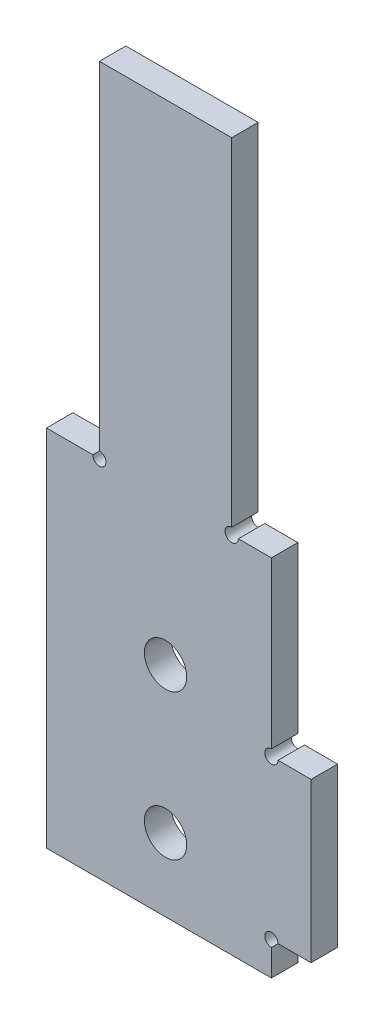
ISO-10303-21;
HEADER;
FILE_DESCRIPTION(('STEP AP214'),'2;1');
FILE_NAME('part.step','',(''),(''),'','','');
FILE_SCHEMA(('AUTOMOTIVE_DESIGN { 1 0 10303 214 1 1 1 1 }'));
ENDSEC;
DATA;
#1=APPLICATION_CONTEXT('core data for automotive mechanical design processes');
#2=APPLICATION_PROTOCOL_DEFINITION('international standard','automotive_design',2000,#1);
#3=PRODUCT_CONTEXT('',#1,'mechanical');
#4=PRODUCT('Part','Part','',(#3));
#5=PRODUCT_RELATED_PRODUCT_CATEGORY('part','',(#4));
#6=PRODUCT_DEFINITION_FORMATION('','',#4);
#7=PRODUCT_DEFINITION_CONTEXT('part definition',#1,'design');
#8=PRODUCT_DEFINITION('design','',#6,#7);
#9=PRODUCT_DEFINITION_SHAPE('','',#8);
#10=(LENGTH_UNIT() NAMED_UNIT(*) SI_UNIT(.MILLI.,.METRE.));
#11=(NAMED_UNIT(*) PLANE_ANGLE_UNIT() SI_UNIT($,.RADIAN.));
#12=(NAMED_UNIT(*) SI_UNIT($,.STERADIAN.) SOLID_ANGLE_UNIT());
#13=UNCERTAINTY_MEASURE_WITH_UNIT(LENGTH_MEASURE(1.E-05),#10,'distance_accuracy_value','');
#14=(GEOMETRIC_REPRESENTATION_CONTEXT(3) GLOBAL_UNCERTAINTY_ASSIGNED_CONTEXT((#13)) GLOBAL_UNIT_ASSIGNED_CONTEXT((#10,
#11,#12)) REPRESENTATION_CONTEXT('',''));
#15=CARTESIAN_POINT('',(0.,0.,0.));
#16=DIRECTION('',(0.,0.,1.));
#17=DIRECTION('',(1.,0.,0.));
#18=AXIS2_PLACEMENT_3D('',#15,#16,#17);
#19=CARTESIAN_POINT('',(0.,0.,2.));
#20=DIRECTION('',(1.,0.,0.));
#21=DIRECTION('',(0.,0.,-1.));
#22=AXIS2_PLACEMENT_3D('',#19,#20,#21);
#23=PLANE('',#22);
#24=DIRECTION('',(0.,-1.,0.));
#25=VECTOR('',#24,1.);
#26=CARTESIAN_POINT('',(0.,0.,2.));
#27=LINE('',#26,#25);
#28=CARTESIAN_POINT('',(0.,27.5,2.));
#29=VERTEX_POINT('',#28);
#30=CARTESIAN_POINT('',(0.,0.,2.));
#31=VERTEX_POINT('',#30);
#32=EDGE_CURVE('E194',#29,#31,#27,.T.);
#33=ORIENTED_EDGE('',*,*,#32,.F.);
#34=DIRECTION('',(0.,0.,1.));
#35=VECTOR('',#34,1.);
#36=CARTESIAN_POINT('',(0.,27.5,0.));
#37=LINE('',#36,#35);
#38=CARTESIAN_POINT('',(0.,27.5,0.));
#39=VERTEX_POINT('',#38);
#40=EDGE_CURVE('E230',#39,#29,#37,.T.);
#41=ORIENTED_EDGE('',*,*,#40,.F.);
#42=DIRECTION('',(0.,-1.,0.));
#43=VECTOR('',#42,1.);
#44=CARTESIAN_POINT('',(0.,0.,0.));
#45=LINE('',#44,#43);
#46=CARTESIAN_POINT('',(0.,0.,0.));
#47=VERTEX_POINT('',#46);
#48=EDGE_CURVE('E177',#39,#47,#45,.T.);
#49=ORIENTED_EDGE('',*,*,#48,.T.);
#50=DIRECTION('',(0.,0.,-1.));
#51=VECTOR('',#50,1.);
#52=CARTESIAN_POINT('',(0.,0.,2.));
#53=LINE('',#52,#51);
#54=EDGE_CURVE('E201',#31,#47,#53,.T.);
#55=ORIENTED_EDGE('',*,*,#54,.F.);
#56=EDGE_LOOP('',(#33,#41,#49,#55));
#57=FACE_BOUND('',#56,.T.);
#58=ADVANCED_FACE('F34',(#57),#23,.F.);
#59=CARTESIAN_POINT('',(0.,0.,2.));
#60=DIRECTION('',(0.,1.,0.));
#61=DIRECTION('',(-1.,0.,0.));
#62=AXIS2_PLACEMENT_3D('',#59,#60,#61);
#63=PLANE('',#62);
#64=DIRECTION('',(1.,0.,0.));
#65=VECTOR('',#64,1.);
#66=CARTESIAN_POINT('',(0.,0.,0.));
#67=LINE('',#66,#65);
#68=CARTESIAN_POINT('',(17.,0.,0.));
#69=VERTEX_POINT('',#68);
#70=EDGE_CURVE('E179',#47,#69,#67,.T.);
#71=ORIENTED_EDGE('',*,*,#70,.T.);
#72=DIRECTION('',(0.,0.,-1.));
#73=VECTOR('',#72,1.);
#74=CARTESIAN_POINT('',(17.,0.,2.));
#75=LINE('',#74,#73);
#76=CARTESIAN_POINT('',(17.,0.,2.));
#77=VERTEX_POINT('',#76);
#78=EDGE_CURVE('E198',#77,#69,#75,.T.);
#79=ORIENTED_EDGE('',*,*,#78,.F.);
#80=DIRECTION('',(1.,0.,0.));
#81=VECTOR('',#80,1.);
#82=CARTESIAN_POINT('',(0.,0.,2.));
#83=LINE('',#82,#81);
#84=EDGE_CURVE('E169',#31,#77,#83,.T.);
#85=ORIENTED_EDGE('',*,*,#84,.F.);
#86=ORIENTED_EDGE('',*,*,#54,.T.);
#87=EDGE_LOOP('',(#71,#79,#85,#86));
#88=FACE_BOUND('',#87,.T.);
#89=ADVANCED_FACE('F257',(#88),#63,.F.);
#90=CARTESIAN_POINT('',(17.,0.,2.));
#91=DIRECTION('',(-1.,0.,0.));
#92=DIRECTION('',(0.,0.,1.));
#93=AXIS2_PLACEMENT_3D('',#90,#91,#92);
#94=PLANE('',#93);
#95=DIRECTION('',(0.,1.,0.));
#96=VECTOR('',#95,1.);
#97=CARTESIAN_POINT('',(17.,0.,0.));
#98=LINE('',#97,#96);
#99=CARTESIAN_POINT('',(17.,2.,0.));
#100=VERTEX_POINT('',#99);
#101=EDGE_CURVE('E182',#69,#100,#98,.T.);
#102=ORIENTED_EDGE('',*,*,#101,.T.);
#103=DIRECTION('',(0.,0.,-1.));
#104=VECTOR('',#103,1.);
#105=CARTESIAN_POINT('',(17.,2.,2.));
#106=LINE('',#105,#104);
#107=CARTESIAN_POINT('',(17.,2.,2.));
#108=VERTEX_POINT('',#107);
#109=EDGE_CURVE('E48',#100,#108,#106,.F.);
#110=ORIENTED_EDGE('',*,*,#109,.T.);
#111=DIRECTION('',(0.,1.,0.));
#112=VECTOR('',#111,1.);
#113=CARTESIAN_POINT('',(17.,0.,2.));
#114=LINE('',#113,#112);
#115=EDGE_CURVE('E159',#77,#108,#114,.T.);
#116=ORIENTED_EDGE('',*,*,#115,.F.);
#117=ORIENTED_EDGE('',*,*,#78,.T.);
#118=EDGE_LOOP('',(#102,#110,#116,#117));
#119=FACE_BOUND('',#118,.T.);
#120=ADVANCED_FACE('F260',(#119),#94,.F.);
#121=CARTESIAN_POINT('',(20.,2.5,2.));
#122=DIRECTION('',(0.,1.,0.));
#123=DIRECTION('',(0.,0.,1.));
#124=AXIS2_PLACEMENT_3D('',#121,#122,#123);
#125=PLANE('',#124);
#126=DIRECTION('',(1.,0.,0.));
#127=VECTOR('',#126,1.);
#128=CARTESIAN_POINT('',(20.,2.5,2.));
#129=LINE('',#128,#127);
#130=CARTESIAN_POINT('',(17.5,2.5,2.));
#131=VERTEX_POINT('',#130);
#132=CARTESIAN_POINT('',(20.,2.5,2.));
#133=VERTEX_POINT('',#132);
#134=EDGE_CURVE('E156',#131,#133,#129,.T.);
#135=ORIENTED_EDGE('',*,*,#134,.F.);
#136=DIRECTION('',(0.,0.,-1.));
#137=VECTOR('',#136,1.);
#138=CARTESIAN_POINT('',(17.5,2.5,2.));
#139=LINE('',#138,#137);
#140=CARTESIAN_POINT('',(17.5,2.5,0.));
#141=VERTEX_POINT('',#140);
#142=EDGE_CURVE('E143',#131,#141,#139,.T.);
#143=ORIENTED_EDGE('',*,*,#142,.T.);
#144=DIRECTION('',(1.,0.,0.));
#145=VECTOR('',#144,1.);
#146=CARTESIAN_POINT('',(20.,2.5,0.));
#147=LINE('',#146,#145);
#148=CARTESIAN_POINT('',(20.,2.5,0.));
#149=VERTEX_POINT('',#148);
#150=EDGE_CURVE('E185',#141,#149,#147,.T.);
#151=ORIENTED_EDGE('',*,*,#150,.T.);
#152=DIRECTION('',(0.,0.,-1.));
#153=VECTOR('',#152,1.);
#154=CARTESIAN_POINT('',(20.,2.5,2.));
#155=LINE('',#154,#153);
#156=EDGE_CURVE('E163',#133,#149,#155,.T.);
#157=ORIENTED_EDGE('',*,*,#156,.F.);
#158=EDGE_LOOP('',(#135,#143,#151,#157));
#159=FACE_BOUND('',#158,.T.);
#160=ADVANCED_FACE('F161',(#159),#125,.F.);
#161=CARTESIAN_POINT('',(20.,2.5,2.));
#162=DIRECTION('',(-1.,0.,0.));
#163=DIRECTION('',(0.,-1.,0.));
#164=AXIS2_PLACEMENT_3D('',#161,#162,#163);
#165=PLANE('',#164);
#166=DIRECTION('',(0.,1.,0.));
#167=VECTOR('',#166,1.);
#168=CARTESIAN_POINT('',(20.,2.5,0.));
#169=LINE('',#168,#167);
#170=CARTESIAN_POINT('',(20.,14.5,0.));
#171=VERTEX_POINT('',#170);
#172=EDGE_CURVE('E187',#149,#171,#169,.T.);
#173=ORIENTED_EDGE('',*,*,#172,.T.);
#174=DIRECTION('',(0.,0.,-1.));
#175=VECTOR('',#174,1.);
#176=CARTESIAN_POINT('',(20.,14.5,2.));
#177=LINE('',#176,#175);
#178=CARTESIAN_POINT('',(20.,14.5,2.));
#179=VERTEX_POINT('',#178);
#180=EDGE_CURVE('E176',#179,#171,#177,.T.);
#181=ORIENTED_EDGE('',*,*,#180,.F.);
#182=DIRECTION('',(0.,1.,0.));
#183=VECTOR('',#182,1.);
#184=CARTESIAN_POINT('',(20.,2.5,2.));
#185=LINE('',#184,#183);
#186=EDGE_CURVE('E165',#133,#179,#185,.T.);
#187=ORIENTED_EDGE('',*,*,#186,.F.);
#188=ORIENTED_EDGE('',*,*,#156,.T.);
#189=EDGE_LOOP('',(#173,#181,#187,#188));
#190=FACE_BOUND('',#189,.T.);
#191=ADVANCED_FACE('F344',(#190),#165,.F.);
#192=CARTESIAN_POINT('',(20.,14.5,2.));
#193=DIRECTION('',(0.,-1.,0.));
#194=DIRECTION('',(1.,0.,0.));
#195=AXIS2_PLACEMENT_3D('',#192,#193,#194);
#196=PLANE('',#195);
#197=DIRECTION('',(-1.,0.,0.));
#198=VECTOR('',#197,1.);
#199=CARTESIAN_POINT('',(20.,14.5,0.));
#200=LINE('',#199,#198);
#201=CARTESIAN_POINT('',(17.5,14.5,0.));
#202=VERTEX_POINT('',#201);
#203=EDGE_CURVE('E189',#171,#202,#200,.T.);
#204=ORIENTED_EDGE('',*,*,#203,.T.);
#205=DIRECTION('',(0.,0.,-1.));
#206=VECTOR('',#205,1.);
#207=CARTESIAN_POINT('',(17.5,14.5,2.));
#208=LINE('',#207,#206);
#209=CARTESIAN_POINT('',(17.5,14.5,2.));
#210=VERTEX_POINT('',#209);
#211=EDGE_CURVE('E55',#202,#210,#208,.F.);
#212=ORIENTED_EDGE('',*,*,#211,.T.);
#213=DIRECTION('',(-1.,0.,0.));
#214=VECTOR('',#213,1.);
#215=CARTESIAN_POINT('',(20.,14.5,2.));
#216=LINE('',#215,#214);
#217=EDGE_CURVE('E167',#179,#210,#216,.T.);
#218=ORIENTED_EDGE('',*,*,#217,.F.);
#219=ORIENTED_EDGE('',*,*,#180,.T.);
#220=EDGE_LOOP('',(#204,#212,#218,#219));
#221=FACE_BOUND('',#220,.T.);
#222=ADVANCED_FACE('F349',(#221),#196,.F.);
#223=CARTESIAN_POINT('',(17.,51.5,2.));
#224=DIRECTION('',(-1.,0.,0.));
#225=DIRECTION('',(0.,-1.,0.));
#226=AXIS2_PLACEMENT_3D('',#223,#224,#225);
#227=PLANE('',#226);
#228=DIRECTION('',(0.,1.,0.));
#229=VECTOR('',#228,1.);
#230=CARTESIAN_POINT('',(17.,51.5,2.));
#231=LINE('',#230,#229);
#232=CARTESIAN_POINT('',(17.,15.,2.));
#233=VERTEX_POINT('',#232);
#234=CARTESIAN_POINT('',(17.,27.5,2.));
#235=VERTEX_POINT('',#234);
#236=EDGE_CURVE('E174',#233,#235,#231,.T.);
#237=ORIENTED_EDGE('',*,*,#236,.F.);
#238=DIRECTION('',(0.,0.,-1.));
#239=VECTOR('',#238,1.);
#240=CARTESIAN_POINT('',(17.,15.,2.));
#241=LINE('',#240,#239);
#242=CARTESIAN_POINT('',(17.,15.,0.));
#243=VERTEX_POINT('',#242);
#244=EDGE_CURVE('E261',#233,#243,#241,.T.);
#245=ORIENTED_EDGE('',*,*,#244,.T.);
#246=DIRECTION('',(0.,1.,0.));
#247=VECTOR('',#246,1.);
#248=CARTESIAN_POINT('',(17.,51.5,0.));
#249=LINE('',#248,#247);
#250=CARTESIAN_POINT('',(17.,27.5,0.));
#251=VERTEX_POINT('',#250);
#252=EDGE_CURVE('E192',#243,#251,#249,.T.);
#253=ORIENTED_EDGE('',*,*,#252,.T.);
#254=DIRECTION('',(0.,0.,1.));
#255=VECTOR('',#254,1.);
#256=CARTESIAN_POINT('',(17.,27.5,0.));
#257=LINE('',#256,#255);
#258=EDGE_CURVE('E234',#251,#235,#257,.T.);
#259=ORIENTED_EDGE('',*,*,#258,.T.);
#260=EDGE_LOOP('',(#237,#245,#253,#259));
#261=FACE_BOUND('',#260,.T.);
#262=ADVANCED_FACE('F309',(#261),#227,.F.);
#263=CARTESIAN_POINT('',(0.,0.,2.));
#264=DIRECTION('',(0.,0.,-1.));
#265=DIRECTION('',(-1.,0.,0.));
#266=AXIS2_PLACEMENT_3D('',#263,#264,#265);
#267=PLANE('',#266);
#268=CARTESIAN_POINT('',(9.,5.5,2.));
#269=DIRECTION('',(0.,0.,1.));
#270=DIRECTION('',(1.,0.,0.));
#271=AXIS2_PLACEMENT_3D('',#268,#269,#270);
#272=CIRCLE('',#271,1.6);
#273=CARTESIAN_POINT('',(10.6,5.5,2.));
#274=VERTEX_POINT('',#273);
#275=EDGE_CURVE('E243',#274,#274,#272,.T.);
#276=ORIENTED_EDGE('',*,*,#275,.F.);
#277=EDGE_LOOP('',(#276));
#278=FACE_BOUND('',#277,.T.);
#279=CARTESIAN_POINT('',(9.,16.5,2.));
#280=DIRECTION('',(0.,0.,1.));
#281=DIRECTION('',(1.,0.,0.));
#282=AXIS2_PLACEMENT_3D('',#279,#280,#281);
#283=CIRCLE('',#282,1.6);
#284=CARTESIAN_POINT('',(10.6,16.5,2.));
#285=VERTEX_POINT('',#284);
#286=EDGE_CURVE('E249',#285,#285,#283,.T.);
#287=ORIENTED_EDGE('',*,*,#286,.F.);
#288=EDGE_LOOP('',(#287));
#289=FACE_BOUND('',#288,.T.);
#290=ORIENTED_EDGE('',*,*,#217,.T.);
#291=CARTESIAN_POINT('',(17.,14.5,2.));
#292=DIRECTION('',(0.,0.,-1.));
#293=DIRECTION('',(-1.,0.,0.));
#294=AXIS2_PLACEMENT_3D('',#291,#292,#293);
#295=CIRCLE('',#294,0.499999999999999);
#296=EDGE_CURVE('E150',#210,#233,#295,.T.);
#297=ORIENTED_EDGE('',*,*,#296,.T.);
#298=ORIENTED_EDGE('',*,*,#236,.T.);
#299=DIRECTION('',(1.,0.,0.));
#300=VECTOR('',#299,1.);
#301=CARTESIAN_POINT('',(17.,27.5,2.));
#302=LINE('',#301,#300);
#303=CARTESIAN_POINT('',(14.5,27.5,2.));
#304=VERTEX_POINT('',#303);
#305=EDGE_CURVE('E296',#304,#235,#302,.T.);
#306=ORIENTED_EDGE('',*,*,#305,.F.);
#307=CARTESIAN_POINT('',(14.,27.5,2.));
#308=DIRECTION('',(0.,0.,-1.));
#309=DIRECTION('',(-1.,0.,0.));
#310=AXIS2_PLACEMENT_3D('',#307,#308,#309);
#311=CIRCLE('',#310,0.500000000000001);
#312=CARTESIAN_POINT('',(14.,28.,2.));
#313=VERTEX_POINT('',#312);
#314=EDGE_CURVE('E267',#304,#313,#311,.T.);
#315=ORIENTED_EDGE('',*,*,#314,.T.);
#316=DIRECTION('',(0.,-1.,0.));
#317=VECTOR('',#316,1.);
#318=CARTESIAN_POINT('',(14.,51.5,2.));
#319=LINE('',#318,#317);
#320=CARTESIAN_POINT('',(14.,53.5,2.));
#321=VERTEX_POINT('',#320);
#322=EDGE_CURVE('E240',#321,#313,#319,.T.);
#323=ORIENTED_EDGE('',*,*,#322,.F.);
#324=DIRECTION('',(1.,0.,0.));
#325=VECTOR('',#324,1.);
#326=CARTESIAN_POINT('',(4.,53.5,2.));
#327=LINE('',#326,#325);
#328=CARTESIAN_POINT('',(4.,53.5,2.));
#329=VERTEX_POINT('',#328);
#330=EDGE_CURVE('E284',#329,#321,#327,.T.);
#331=ORIENTED_EDGE('',*,*,#330,.F.);
#332=DIRECTION('',(0.,1.,0.));
#333=VECTOR('',#332,1.);
#334=CARTESIAN_POINT('',(4.,51.5,2.));
#335=LINE('',#334,#333);
#336=CARTESIAN_POINT('',(4.,28.,2.));
#337=VERTEX_POINT('',#336);
#338=EDGE_CURVE('E228',#337,#329,#335,.T.);
#339=ORIENTED_EDGE('',*,*,#338,.F.);
#340=CARTESIAN_POINT('',(4.,27.5,2.));
#341=DIRECTION('',(0.,0.,-1.));
#342=DIRECTION('',(-1.,0.,0.));
#343=AXIS2_PLACEMENT_3D('',#340,#341,#342);
#344=CIRCLE('',#343,0.5);
#345=CARTESIAN_POINT('',(3.5,27.5,2.));
#346=VERTEX_POINT('',#345);
#347=EDGE_CURVE('E273',#337,#346,#344,.T.);
#348=ORIENTED_EDGE('',*,*,#347,.T.);
#349=DIRECTION('',(1.,0.,0.));
#350=VECTOR('',#349,1.);
#351=CARTESIAN_POINT('',(0.,27.5,2.));
#352=LINE('',#351,#350);
#353=EDGE_CURVE('E216',#29,#346,#352,.T.);
#354=ORIENTED_EDGE('',*,*,#353,.F.);
#355=ORIENTED_EDGE('',*,*,#32,.T.);
#356=ORIENTED_EDGE('',*,*,#84,.T.);
#357=ORIENTED_EDGE('',*,*,#115,.T.);
#358=CARTESIAN_POINT('',(17.,2.5,2.));
#359=DIRECTION('',(0.,0.,-1.));
#360=DIRECTION('',(-1.,0.,0.));
#361=AXIS2_PLACEMENT_3D('',#358,#359,#360);
#362=CIRCLE('',#361,0.499999999999999);
#363=EDGE_CURVE('E146',#108,#131,#362,.T.);
#364=ORIENTED_EDGE('',*,*,#363,.T.);
#365=ORIENTED_EDGE('',*,*,#134,.T.);
#366=ORIENTED_EDGE('',*,*,#186,.T.);
#367=EDGE_LOOP('',(#290,#297,#298,#306,#315,#323,#331,#339,#348,#354,#355,#356,#357,#364,#365,#366));
#368=FACE_BOUND('',#367,.T.);
#369=ADVANCED_FACE('F155',(#278,#289,#368),#267,.F.);
#370=CARTESIAN_POINT('',(0.,0.,0.));
#371=DIRECTION('',(0.,0.,-1.));
#372=DIRECTION('',(-1.,0.,0.));
#373=AXIS2_PLACEMENT_3D('',#370,#371,#372);
#374=PLANE('',#373);
#375=CARTESIAN_POINT('',(17.,14.5,0.));
#376=DIRECTION('',(0.,0.,-1.));
#377=DIRECTION('',(-1.,0.,0.));
#378=AXIS2_PLACEMENT_3D('',#375,#376,#377);
#379=CIRCLE('',#378,0.499999999999999);
#380=EDGE_CURVE('E11',#202,#243,#379,.T.);
#381=ORIENTED_EDGE('',*,*,#380,.F.);
#382=ORIENTED_EDGE('',*,*,#203,.F.);
#383=ORIENTED_EDGE('',*,*,#172,.F.);
#384=ORIENTED_EDGE('',*,*,#150,.F.);
#385=CARTESIAN_POINT('',(17.,2.5,0.));
#386=DIRECTION('',(0.,0.,-1.));
#387=DIRECTION('',(-1.,0.,0.));
#388=AXIS2_PLACEMENT_3D('',#385,#386,#387);
#389=CIRCLE('',#388,0.499999999999999);
#390=EDGE_CURVE('E41',#100,#141,#389,.T.);
#391=ORIENTED_EDGE('',*,*,#390,.F.);
#392=ORIENTED_EDGE('',*,*,#101,.F.);
#393=ORIENTED_EDGE('',*,*,#70,.F.);
#394=ORIENTED_EDGE('',*,*,#48,.F.);
#395=DIRECTION('',(1.,0.,0.));
#396=VECTOR('',#395,1.);
#397=CARTESIAN_POINT('',(0.,27.5,0.));
#398=LINE('',#397,#396);
#399=CARTESIAN_POINT('',(3.5,27.5,0.));
#400=VERTEX_POINT('',#399);
#401=EDGE_CURVE('E213',#39,#400,#398,.T.);
#402=ORIENTED_EDGE('',*,*,#401,.T.);
#403=CARTESIAN_POINT('',(4.,27.5,0.));
#404=DIRECTION('',(0.,0.,-1.));
#405=DIRECTION('',(-1.,0.,0.));
#406=AXIS2_PLACEMENT_3D('',#403,#404,#405);
#407=CIRCLE('',#406,0.5);
#408=CARTESIAN_POINT('',(4.,28.,0.));
#409=VERTEX_POINT('',#408);
#410=EDGE_CURVE('E224',#409,#400,#407,.T.);
#411=ORIENTED_EDGE('',*,*,#410,.F.);
#412=DIRECTION('',(0.,1.,0.));
#413=VECTOR('',#412,1.);
#414=CARTESIAN_POINT('',(4.,51.5,0.));
#415=LINE('',#414,#413);
#416=CARTESIAN_POINT('',(4.,53.5,0.));
#417=VERTEX_POINT('',#416);
#418=EDGE_CURVE('E227',#409,#417,#415,.T.);
#419=ORIENTED_EDGE('',*,*,#418,.T.);
#420=DIRECTION('',(-1.,0.,0.));
#421=VECTOR('',#420,1.);
#422=CARTESIAN_POINT('',(4.,53.5,0.));
#423=LINE('',#422,#421);
#424=CARTESIAN_POINT('',(14.,53.5,0.));
#425=VERTEX_POINT('',#424);
#426=EDGE_CURVE('E237',#425,#417,#423,.T.);
#427=ORIENTED_EDGE('',*,*,#426,.F.);
#428=DIRECTION('',(0.,-1.,0.));
#429=VECTOR('',#428,1.);
#430=CARTESIAN_POINT('',(14.,51.5,0.));
#431=LINE('',#430,#429);
#432=CARTESIAN_POINT('',(14.,28.,0.));
#433=VERTEX_POINT('',#432);
#434=EDGE_CURVE('E292',#425,#433,#431,.T.);
#435=ORIENTED_EDGE('',*,*,#434,.T.);
#436=CARTESIAN_POINT('',(14.,27.5,0.));
#437=DIRECTION('',(0.,0.,-1.));
#438=DIRECTION('',(-1.,0.,0.));
#439=AXIS2_PLACEMENT_3D('',#436,#437,#438);
#440=CIRCLE('',#439,0.500000000000001);
#441=CARTESIAN_POINT('',(14.5,27.5,0.));
#442=VERTEX_POINT('',#441);
#443=EDGE_CURVE('E271',#442,#433,#440,.T.);
#444=ORIENTED_EDGE('',*,*,#443,.F.);
#445=DIRECTION('',(1.,0.,0.));
#446=VECTOR('',#445,1.);
#447=CARTESIAN_POINT('',(17.,27.5,0.));
#448=LINE('',#447,#446);
#449=EDGE_CURVE('E295',#442,#251,#448,.T.);
#450=ORIENTED_EDGE('',*,*,#449,.T.);
#451=ORIENTED_EDGE('',*,*,#252,.F.);
#452=EDGE_LOOP('',(#381,#382,#383,#384,#391,#392,#393,#394,#402,#411,#419,#427,#435,#444,#450,#451));
#453=FACE_BOUND('',#452,.T.);
#454=CARTESIAN_POINT('',(9.,5.5,0.));
#455=DIRECTION('',(0.,0.,1.));
#456=DIRECTION('',(1.,0.,0.));
#457=AXIS2_PLACEMENT_3D('',#454,#455,#456);
#458=CIRCLE('',#457,1.6);
#459=CARTESIAN_POINT('',(10.6,5.5,0.));
#460=VERTEX_POINT('',#459);
#461=EDGE_CURVE('E180',#460,#460,#458,.T.);
#462=ORIENTED_EDGE('',*,*,#461,.T.);
#463=EDGE_LOOP('',(#462));
#464=FACE_BOUND('',#463,.T.);
#465=CARTESIAN_POINT('',(9.,16.5,0.));
#466=DIRECTION('',(0.,0.,1.));
#467=DIRECTION('',(1.,0.,0.));
#468=AXIS2_PLACEMENT_3D('',#465,#466,#467);
#469=CIRCLE('',#468,1.6);
#470=CARTESIAN_POINT('',(10.6,16.5,0.));
#471=VERTEX_POINT('',#470);
#472=EDGE_CURVE('E246',#471,#471,#469,.T.);
#473=ORIENTED_EDGE('',*,*,#472,.T.);
#474=EDGE_LOOP('',(#473));
#475=FACE_BOUND('',#474,.T.);
#476=ADVANCED_FACE('F222',(#453,#464,#475),#374,.T.);
#477=CARTESIAN_POINT('',(9.,16.5,0.));
#478=DIRECTION('',(0.,0.,1.));
#479=DIRECTION('',(1.,0.,0.));
#480=AXIS2_PLACEMENT_3D('',#477,#478,#479);
#481=CYLINDRICAL_SURFACE('',#480,1.6);
#482=ORIENTED_EDGE('',*,*,#472,.F.);
#483=EDGE_LOOP('',(#482));
#484=FACE_BOUND('',#483,.T.);
#485=ORIENTED_EDGE('',*,*,#286,.T.);
#486=EDGE_LOOP('',(#485));
#487=FACE_BOUND('',#486,.T.);
#488=ADVANCED_FACE('F369',(#484,#487),#481,.F.);
#489=CARTESIAN_POINT('',(9.,5.5,0.));
#490=DIRECTION('',(0.,0.,1.));
#491=DIRECTION('',(1.,0.,0.));
#492=AXIS2_PLACEMENT_3D('',#489,#490,#491);
#493=CYLINDRICAL_SURFACE('',#492,1.6);
#494=ORIENTED_EDGE('',*,*,#461,.F.);
#495=EDGE_LOOP('',(#494));
#496=FACE_BOUND('',#495,.T.);
#497=ORIENTED_EDGE('',*,*,#275,.T.);
#498=EDGE_LOOP('',(#497));
#499=FACE_BOUND('',#498,.T.);
#500=ADVANCED_FACE('F462',(#496,#499),#493,.F.);
#501=CARTESIAN_POINT('',(4.,51.5,0.));
#502=DIRECTION('',(1.,0.,0.));
#503=DIRECTION('',(0.,1.,0.));
#504=AXIS2_PLACEMENT_3D('',#501,#502,#503);
#505=PLANE('',#504);
#506=ORIENTED_EDGE('',*,*,#418,.F.);
#507=DIRECTION('',(0.,0.,-1.));
#508=VECTOR('',#507,1.);
#509=CARTESIAN_POINT('',(4.,28.,2.));
#510=LINE('',#509,#508);
#511=EDGE_CURVE('E278',#409,#337,#510,.F.);
#512=ORIENTED_EDGE('',*,*,#511,.T.);
#513=ORIENTED_EDGE('',*,*,#338,.T.);
#514=DIRECTION('',(0.,0.,1.));
#515=VECTOR('',#514,1.);
#516=CARTESIAN_POINT('',(4.,53.5,2.));
#517=LINE('',#516,#515);
#518=EDGE_CURVE('E281',#417,#329,#517,.T.);
#519=ORIENTED_EDGE('',*,*,#518,.F.);
#520=EDGE_LOOP('',(#506,#512,#513,#519));
#521=FACE_BOUND('',#520,.T.);
#522=ADVANCED_FACE('F324',(#521),#505,.F.);
#523=CARTESIAN_POINT('',(0.,27.5,0.));
#524=DIRECTION('',(0.,-1.,0.));
#525=DIRECTION('',(1.,0.,0.));
#526=AXIS2_PLACEMENT_3D('',#523,#524,#525);
#527=PLANE('',#526);
#528=ORIENTED_EDGE('',*,*,#353,.T.);
#529=DIRECTION('',(0.,0.,-1.));
#530=VECTOR('',#529,1.);
#531=CARTESIAN_POINT('',(3.5,27.5,2.));
#532=LINE('',#531,#530);
#533=EDGE_CURVE('E207',#346,#400,#532,.T.);
#534=ORIENTED_EDGE('',*,*,#533,.T.);
#535=ORIENTED_EDGE('',*,*,#401,.F.);
#536=ORIENTED_EDGE('',*,*,#40,.T.);
#537=EDGE_LOOP('',(#528,#534,#535,#536));
#538=FACE_BOUND('',#537,.T.);
#539=ADVANCED_FACE('F212',(#538),#527,.F.);
#540=CARTESIAN_POINT('',(17.,27.5,0.));
#541=DIRECTION('',(0.,-1.,0.));
#542=DIRECTION('',(0.,0.,-1.));
#543=AXIS2_PLACEMENT_3D('',#540,#541,#542);
#544=PLANE('',#543);
#545=ORIENTED_EDGE('',*,*,#449,.F.);
#546=DIRECTION('',(0.,0.,-1.));
#547=VECTOR('',#546,1.);
#548=CARTESIAN_POINT('',(14.5,27.5,2.));
#549=LINE('',#548,#547);
#550=EDGE_CURVE('E270',#442,#304,#549,.F.);
#551=ORIENTED_EDGE('',*,*,#550,.T.);
#552=ORIENTED_EDGE('',*,*,#305,.T.);
#553=ORIENTED_EDGE('',*,*,#258,.F.);
#554=EDGE_LOOP('',(#545,#551,#552,#553));
#555=FACE_BOUND('',#554,.T.);
#556=ADVANCED_FACE('F306',(#555),#544,.F.);
#557=CARTESIAN_POINT('',(14.,51.5,0.));
#558=DIRECTION('',(-1.,0.,0.));
#559=DIRECTION('',(0.,-1.,0.));
#560=AXIS2_PLACEMENT_3D('',#557,#558,#559);
#561=PLANE('',#560);
#562=ORIENTED_EDGE('',*,*,#322,.T.);
#563=DIRECTION('',(0.,0.,-1.));
#564=VECTOR('',#563,1.);
#565=CARTESIAN_POINT('',(14.,28.,2.));
#566=LINE('',#565,#564);
#567=EDGE_CURVE('E204',#313,#433,#566,.T.);
#568=ORIENTED_EDGE('',*,*,#567,.T.);
#569=ORIENTED_EDGE('',*,*,#434,.F.);
#570=DIRECTION('',(0.,0.,-1.));
#571=VECTOR('',#570,1.);
#572=CARTESIAN_POINT('',(14.,53.5,2.));
#573=LINE('',#572,#571);
#574=EDGE_CURVE('E287',#321,#425,#573,.T.);
#575=ORIENTED_EDGE('',*,*,#574,.F.);
#576=EDGE_LOOP('',(#562,#568,#569,#575));
#577=FACE_BOUND('',#576,.T.);
#578=ADVANCED_FACE('F316',(#577),#561,.F.);
#579=CARTESIAN_POINT('',(0.,53.5,0.));
#580=DIRECTION('',(0.,-1.,0.));
#581=DIRECTION('',(0.,0.,-1.));
#582=AXIS2_PLACEMENT_3D('',#579,#580,#581);
#583=PLANE('',#582);
#584=ORIENTED_EDGE('',*,*,#518,.T.);
#585=ORIENTED_EDGE('',*,*,#330,.T.);
#586=ORIENTED_EDGE('',*,*,#574,.T.);
#587=ORIENTED_EDGE('',*,*,#426,.T.);
#588=EDGE_LOOP('',(#584,#585,#586,#587));
#589=FACE_BOUND('',#588,.T.);
#590=ADVANCED_FACE('F321',(#589),#583,.F.);
#591=CARTESIAN_POINT('',(14.,27.5,2.));
#592=DIRECTION('',(0.,0.,-1.));
#593=DIRECTION('',(-1.,0.,0.));
#594=AXIS2_PLACEMENT_3D('',#591,#592,#593);
#595=CYLINDRICAL_SURFACE('',#594,0.500000000000001);
#596=ORIENTED_EDGE('',*,*,#443,.T.);
#597=ORIENTED_EDGE('',*,*,#567,.F.);
#598=ORIENTED_EDGE('',*,*,#314,.F.);
#599=ORIENTED_EDGE('',*,*,#550,.F.);
#600=EDGE_LOOP('',(#596,#597,#598,#599));
#601=FACE_BOUND('',#600,.T.);
#602=ADVANCED_FACE('F314',(#601),#595,.F.);
#603=CARTESIAN_POINT('',(4.,27.5,2.));
#604=DIRECTION('',(0.,0.,-1.));
#605=DIRECTION('',(-1.,0.,0.));
#606=AXIS2_PLACEMENT_3D('',#603,#604,#605);
#607=CYLINDRICAL_SURFACE('',#606,0.5);
#608=ORIENTED_EDGE('',*,*,#410,.T.);
#609=ORIENTED_EDGE('',*,*,#533,.F.);
#610=ORIENTED_EDGE('',*,*,#347,.F.);
#611=ORIENTED_EDGE('',*,*,#511,.F.);
#612=EDGE_LOOP('',(#608,#609,#610,#611));
#613=FACE_BOUND('',#612,.T.);
#614=ADVANCED_FACE('F325',(#613),#607,.F.);
#615=CARTESIAN_POINT('',(17.,2.5,2.));
#616=DIRECTION('',(0.,0.,-1.));
#617=DIRECTION('',(-1.,0.,0.));
#618=AXIS2_PLACEMENT_3D('',#615,#616,#617);
#619=CYLINDRICAL_SURFACE('',#618,0.499999999999999);
#620=ORIENTED_EDGE('',*,*,#390,.T.);
#621=ORIENTED_EDGE('',*,*,#142,.F.);
#622=ORIENTED_EDGE('',*,*,#363,.F.);
#623=ORIENTED_EDGE('',*,*,#109,.F.);
#624=EDGE_LOOP('',(#620,#621,#622,#623));
#625=FACE_BOUND('',#624,.T.);
#626=ADVANCED_FACE('F145',(#625),#619,.F.);
#627=CARTESIAN_POINT('',(17.,14.5,2.));
#628=DIRECTION('',(0.,0.,-1.));
#629=DIRECTION('',(-1.,0.,0.));
#630=AXIS2_PLACEMENT_3D('',#627,#628,#629);
#631=CYLINDRICAL_SURFACE('',#630,0.499999999999999);
#632=ORIENTED_EDGE('',*,*,#380,.T.);
#633=ORIENTED_EDGE('',*,*,#244,.F.);
#634=ORIENTED_EDGE('',*,*,#296,.F.);
#635=ORIENTED_EDGE('',*,*,#211,.F.);
#636=EDGE_LOOP('',(#632,#633,#634,#635));
#637=FACE_BOUND('',#636,.T.);
#638=ADVANCED_FACE('F332',(#637),#631,.F.);
#639=CLOSED_SHELL('',(#58,#89,#120,#160,#191,#222,#262,#369,#476,#488,#500,#522,#539,#556,#578,
#590,#602,#614,#626,#638));
#640=MANIFOLD_SOLID_BREP('B2',#639);
#641=ADVANCED_BREP_SHAPE_REPRESENTATION('',(#18,#640),#14);
#642=SHAPE_DEFINITION_REPRESENTATION(#9,#641);
ENDSEC;
END-ISO-10303-21;
